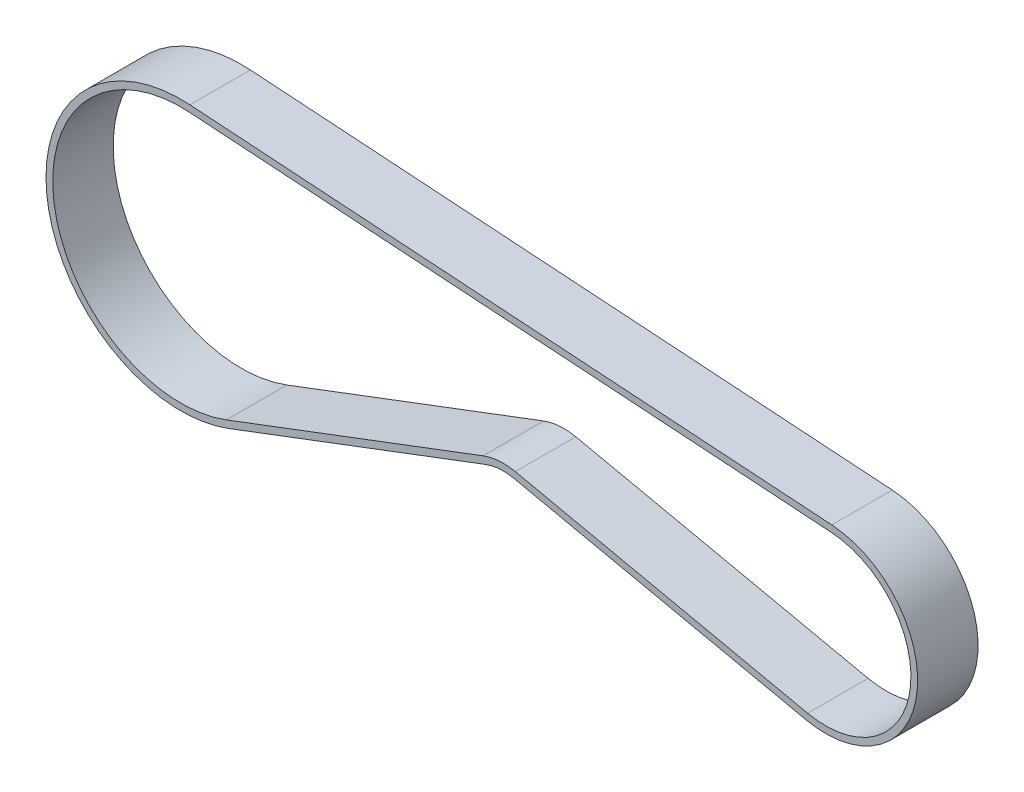
ISO-10303-21;
HEADER;
FILE_DESCRIPTION(('STEP AP214'),'2;1');
FILE_NAME('part.step','',(''),(''),'','','');
FILE_SCHEMA(('AUTOMOTIVE_DESIGN { 1 0 10303 214 1 1 1 1 }'));
ENDSEC;
DATA;
#1=APPLICATION_CONTEXT('core data for automotive mechanical design processes');
#2=APPLICATION_PROTOCOL_DEFINITION('international standard','automotive_design',2000,#1);
#3=PRODUCT_CONTEXT('',#1,'mechanical');
#4=PRODUCT('Part','Part','',(#3));
#5=PRODUCT_RELATED_PRODUCT_CATEGORY('part','',(#4));
#6=PRODUCT_DEFINITION_FORMATION('','',#4);
#7=PRODUCT_DEFINITION_CONTEXT('part definition',#1,'design');
#8=PRODUCT_DEFINITION('design','',#6,#7);
#9=PRODUCT_DEFINITION_SHAPE('','',#8);
#10=(LENGTH_UNIT() NAMED_UNIT(*) SI_UNIT(.MILLI.,.METRE.));
#11=(NAMED_UNIT(*) PLANE_ANGLE_UNIT() SI_UNIT($,.RADIAN.));
#12=(NAMED_UNIT(*) SI_UNIT($,.STERADIAN.) SOLID_ANGLE_UNIT());
#13=UNCERTAINTY_MEASURE_WITH_UNIT(LENGTH_MEASURE(1.E-05),#10,'distance_accuracy_value','');
#14=(GEOMETRIC_REPRESENTATION_CONTEXT(3) GLOBAL_UNCERTAINTY_ASSIGNED_CONTEXT((#13)) GLOBAL_UNIT_ASSIGNED_CONTEXT((#10,
#11,#12)) REPRESENTATION_CONTEXT('',''));
#15=CARTESIAN_POINT('',(0.,0.,0.));
#16=DIRECTION('',(0.,0.,1.));
#17=DIRECTION('',(1.,0.,0.));
#18=AXIS2_PLACEMENT_3D('',#15,#16,#17);
#19=CARTESIAN_POINT('',(0.,0.,4.5));
#20=DIRECTION('',(0.,0.,-1.));
#21=DIRECTION('',(-1.,0.,0.));
#22=AXIS2_PLACEMENT_3D('',#19,#20,#21);
#23=PLANE('',#22);
#24=CARTESIAN_POINT('',(0.,0.,4.5));
#25=DIRECTION('',(0.,0.,1.));
#26=DIRECTION('',(-1.,0.,0.));
#27=AXIS2_PLACEMENT_3D('',#24,#25,#26);
#28=CIRCLE('',#27,13.7);
#29=CARTESIAN_POINT('',(-2.88860996232557,-13.3920100240985,4.5));
#30=VERTEX_POINT('',#29);
#31=CARTESIAN_POINT('',(0.913333333333334,13.6695216530141,4.5));
#32=VERTEX_POINT('',#31);
#33=EDGE_CURVE('E198',#30,#32,#28,.T.);
#34=ORIENTED_EDGE('',*,*,#33,.T.);
#35=DIRECTION('',(-0.997775303139718,0.0666666666666667,0.));
#36=VECTOR('',#35,1.);
#37=CARTESIAN_POINT('',(0.913333333333334,13.6695216530141,4.5));
#38=LINE('',#37,#36);
#39=CARTESIAN_POINT('',(-94.66,20.0552835931083,4.5));
#40=VERTEX_POINT('',#39);
#41=EDGE_CURVE('E202',#32,#40,#38,.T.);
#42=ORIENTED_EDGE('',*,*,#41,.T.);
#43=CARTESIAN_POINT('',(-96.,0.,4.5));
#44=DIRECTION('',(0.,0.,1.));
#45=DIRECTION('',(1.,0.,0.));
#46=AXIS2_PLACEMENT_3D('',#43,#44,#45);
#47=CIRCLE('',#46,20.1);
#48=CARTESIAN_POINT('',(-88.8810079901692,-18.7970729839506,4.5));
#49=VERTEX_POINT('',#48);
#50=EDGE_CURVE('E206',#40,#49,#47,.T.);
#51=ORIENTED_EDGE('',*,*,#50,.T.);
#52=DIRECTION('',(0.935177760395552,0.354178706956756,0.));
#53=VECTOR('',#52,1.);
#54=CARTESIAN_POINT('',(-50.6563403021757,-4.320292259547,4.5));
#55=LINE('',#54,#53);
#56=CARTESIAN_POINT('',(-50.6563403021757,-4.320292259547,4.5));
#57=VERTEX_POINT('',#56);
#58=EDGE_CURVE('E209',#49,#57,#55,.T.);
#59=ORIENTED_EDGE('',*,*,#58,.T.);
#60=CARTESIAN_POINT('',(-48.,-11.3341254625136,4.5));
#61=DIRECTION('',(0.,0.,-1.));
#62=DIRECTION('',(1.,0.,0.));
#63=AXIS2_PLACEMENT_3D('',#60,#61,#62);
#64=CIRCLE('',#63,7.5);
#65=CARTESIAN_POINT('',(-46.4186441812086,-4.00273311355464,4.5));
#66=VERTEX_POINT('',#65);
#67=EDGE_CURVE('E212',#57,#66,#64,.T.);
#68=ORIENTED_EDGE('',*,*,#67,.T.);
#69=DIRECTION('',(0.977518979861201,-0.210847442505517,0.));
#70=VECTOR('',#69,1.);
#71=CARTESIAN_POINT('',(-46.4186441812086,-4.00273311355464,4.5));
#72=LINE('',#71,#70);
#73=EDGE_CURVE('E215',#66,#30,#72,.T.);
#74=ORIENTED_EDGE('',*,*,#73,.T.);
#75=EDGE_LOOP('',(#34,#42,#51,#59,#68,#74));
#76=FACE_BOUND('',#75,.T.);
#77=CARTESIAN_POINT('',(0.,0.,4.5));
#78=DIRECTION('',(0.,0.,1.));
#79=DIRECTION('',(-1.,0.,0.));
#80=AXIS2_PLACEMENT_3D('',#77,#78,#79);
#81=CIRCLE('',#80,12.7);
#82=CARTESIAN_POINT('',(-2.67776251982006,-12.4144910442373,4.5));
#83=VERTEX_POINT('',#82);
#84=CARTESIAN_POINT('',(0.846666666666667,12.6717463498744,4.5));
#85=VERTEX_POINT('',#84);
#86=EDGE_CURVE('E129',#83,#85,#81,.T.);
#87=ORIENTED_EDGE('',*,*,#86,.F.);
#88=DIRECTION('',(0.977518979861201,-0.210847442505517,0.));
#89=VECTOR('',#88,1.);
#90=CARTESIAN_POINT('',(-46.2077967387031,-3.02521413369344,4.5));
#91=LINE('',#90,#89);
#92=CARTESIAN_POINT('',(-46.2077967387031,-3.02521413369344,4.5));
#93=VERTEX_POINT('',#92);
#94=EDGE_CURVE('E164',#93,#83,#91,.T.);
#95=ORIENTED_EDGE('',*,*,#94,.F.);
#96=CARTESIAN_POINT('',(-48.,-11.3341254625136,4.5));
#97=DIRECTION('',(0.,0.,-1.));
#98=DIRECTION('',(1.,0.,0.));
#99=AXIS2_PLACEMENT_3D('',#96,#97,#98);
#100=CIRCLE('',#99,8.5);
#101=CARTESIAN_POINT('',(-51.0105190091324,-3.38511449915145,4.5));
#102=VERTEX_POINT('',#101);
#103=EDGE_CURVE('E161',#102,#93,#100,.T.);
#104=ORIENTED_EDGE('',*,*,#103,.F.);
#105=DIRECTION('',(0.935177760395552,0.354178706956756,0.));
#106=VECTOR('',#105,1.);
#107=CARTESIAN_POINT('',(-51.0105190091324,-3.38511449915145,4.5));
#108=LINE('',#107,#106);
#109=CARTESIAN_POINT('',(-89.235186697126,-17.861895223555,4.5));
#110=VERTEX_POINT('',#109);
#111=EDGE_CURVE('E156',#110,#102,#108,.T.);
#112=ORIENTED_EDGE('',*,*,#111,.F.);
#113=CARTESIAN_POINT('',(-96.,0.,4.5));
#114=DIRECTION('',(0.,0.,1.));
#115=DIRECTION('',(1.,0.,0.));
#116=AXIS2_PLACEMENT_3D('',#113,#114,#115);
#117=CIRCLE('',#116,19.1);
#118=CARTESIAN_POINT('',(-94.7266666666667,19.0575082899686,4.5));
#119=VERTEX_POINT('',#118);
#120=EDGE_CURVE('E152',#119,#110,#117,.T.);
#121=ORIENTED_EDGE('',*,*,#120,.F.);
#122=DIRECTION('',(-0.997775303139718,0.0666666666666667,0.));
#123=VECTOR('',#122,1.);
#124=CARTESIAN_POINT('',(0.846666666666667,12.6717463498744,4.5));
#125=LINE('',#124,#123);
#126=EDGE_CURVE('E138',#85,#119,#125,.T.);
#127=ORIENTED_EDGE('',*,*,#126,.F.);
#128=EDGE_LOOP('',(#87,#95,#104,#112,#121,#127));
#129=FACE_BOUND('',#128,.T.);
#130=ADVANCED_FACE('F39',(#76,#129),#23,.F.);
#131=CARTESIAN_POINT('',(0.,0.,-4.5));
#132=DIRECTION('',(0.,0.,-1.));
#133=DIRECTION('',(-1.,0.,0.));
#134=AXIS2_PLACEMENT_3D('',#131,#132,#133);
#135=PLANE('',#134);
#136=CARTESIAN_POINT('',(0.,0.,-4.5));
#137=DIRECTION('',(0.,0.,1.));
#138=DIRECTION('',(-1.,0.,0.));
#139=AXIS2_PLACEMENT_3D('',#136,#137,#138);
#140=CIRCLE('',#139,13.7);
#141=CARTESIAN_POINT('',(-2.88860996232557,-13.3920100240985,-4.5));
#142=VERTEX_POINT('',#141);
#143=CARTESIAN_POINT('',(0.913333333333334,13.6695216530141,-4.5));
#144=VERTEX_POINT('',#143);
#145=EDGE_CURVE('E147',#142,#144,#140,.T.);
#146=ORIENTED_EDGE('',*,*,#145,.F.);
#147=DIRECTION('',(0.977518979861201,-0.210847442505517,0.));
#148=VECTOR('',#147,1.);
#149=CARTESIAN_POINT('',(-46.4186441812086,-4.00273311355464,-4.5));
#150=LINE('',#149,#148);
#151=CARTESIAN_POINT('',(-46.4186441812086,-4.00273311355464,-4.5));
#152=VERTEX_POINT('',#151);
#153=EDGE_CURVE('E203',#152,#142,#150,.T.);
#154=ORIENTED_EDGE('',*,*,#153,.F.);
#155=CARTESIAN_POINT('',(-48.,-11.3341254625136,-4.5));
#156=DIRECTION('',(0.,0.,-1.));
#157=DIRECTION('',(1.,0.,0.));
#158=AXIS2_PLACEMENT_3D('',#155,#156,#157);
#159=CIRCLE('',#158,7.5);
#160=CARTESIAN_POINT('',(-50.6563403021757,-4.320292259547,-4.5));
#161=VERTEX_POINT('',#160);
#162=EDGE_CURVE('E231',#161,#152,#159,.T.);
#163=ORIENTED_EDGE('',*,*,#162,.F.);
#164=DIRECTION('',(0.935177760395552,0.354178706956756,0.));
#165=VECTOR('',#164,1.);
#166=CARTESIAN_POINT('',(-50.6563403021757,-4.320292259547,-4.5));
#167=LINE('',#166,#165);
#168=CARTESIAN_POINT('',(-88.8810079901692,-18.7970729839506,-4.5));
#169=VERTEX_POINT('',#168);
#170=EDGE_CURVE('E228',#169,#161,#167,.T.);
#171=ORIENTED_EDGE('',*,*,#170,.F.);
#172=CARTESIAN_POINT('',(-96.,0.,-4.5));
#173=DIRECTION('',(0.,0.,1.));
#174=DIRECTION('',(1.,0.,0.));
#175=AXIS2_PLACEMENT_3D('',#172,#173,#174);
#176=CIRCLE('',#175,20.1);
#177=CARTESIAN_POINT('',(-94.66,20.0552835931083,-4.5));
#178=VERTEX_POINT('',#177);
#179=EDGE_CURVE('E225',#178,#169,#176,.T.);
#180=ORIENTED_EDGE('',*,*,#179,.F.);
#181=DIRECTION('',(-0.997775303139718,0.0666666666666667,0.));
#182=VECTOR('',#181,1.);
#183=CARTESIAN_POINT('',(0.913333333333334,13.6695216530141,-4.5));
#184=LINE('',#183,#182);
#185=EDGE_CURVE('E222',#144,#178,#184,.T.);
#186=ORIENTED_EDGE('',*,*,#185,.F.);
#187=EDGE_LOOP('',(#146,#154,#163,#171,#180,#186));
#188=FACE_BOUND('',#187,.T.);
#189=DIRECTION('',(0.977518979861201,-0.210847442505517,0.));
#190=VECTOR('',#189,1.);
#191=CARTESIAN_POINT('',(-46.2077967387031,-3.02521413369344,-4.5));
#192=LINE('',#191,#190);
#193=CARTESIAN_POINT('',(-46.2077967387031,-3.02521413369344,-4.5));
#194=VERTEX_POINT('',#193);
#195=CARTESIAN_POINT('',(-2.67776251982006,-12.4144910442373,-4.5));
#196=VERTEX_POINT('',#195);
#197=EDGE_CURVE('E139',#194,#196,#192,.T.);
#198=ORIENTED_EDGE('',*,*,#197,.T.);
#199=CARTESIAN_POINT('',(0.,0.,-4.5));
#200=DIRECTION('',(0.,0.,1.));
#201=DIRECTION('',(-1.,0.,0.));
#202=AXIS2_PLACEMENT_3D('',#199,#200,#201);
#203=CIRCLE('',#202,12.7);
#204=CARTESIAN_POINT('',(0.846666666666667,12.6717463498744,-4.5));
#205=VERTEX_POINT('',#204);
#206=EDGE_CURVE('E63',#196,#205,#203,.T.);
#207=ORIENTED_EDGE('',*,*,#206,.T.);
#208=DIRECTION('',(-0.997775303139718,0.0666666666666667,0.));
#209=VECTOR('',#208,1.);
#210=CARTESIAN_POINT('',(0.846666666666667,12.6717463498744,-4.5));
#211=LINE('',#210,#209);
#212=CARTESIAN_POINT('',(-94.7266666666667,19.0575082899686,-4.5));
#213=VERTEX_POINT('',#212);
#214=EDGE_CURVE('E145',#205,#213,#211,.T.);
#215=ORIENTED_EDGE('',*,*,#214,.T.);
#216=CARTESIAN_POINT('',(-96.,0.,-4.5));
#217=DIRECTION('',(0.,0.,1.));
#218=DIRECTION('',(1.,0.,0.));
#219=AXIS2_PLACEMENT_3D('',#216,#217,#218);
#220=CIRCLE('',#219,19.1);
#221=CARTESIAN_POINT('',(-89.235186697126,-17.861895223555,-4.5));
#222=VERTEX_POINT('',#221);
#223=EDGE_CURVE('E171',#213,#222,#220,.T.);
#224=ORIENTED_EDGE('',*,*,#223,.T.);
#225=DIRECTION('',(0.935177760395552,0.354178706956756,0.));
#226=VECTOR('',#225,1.);
#227=CARTESIAN_POINT('',(-51.0105190091324,-3.38511449915145,-4.5));
#228=LINE('',#227,#226);
#229=CARTESIAN_POINT('',(-51.0105190091324,-3.38511449915145,-4.5));
#230=VERTEX_POINT('',#229);
#231=EDGE_CURVE('E175',#222,#230,#228,.T.);
#232=ORIENTED_EDGE('',*,*,#231,.T.);
#233=CARTESIAN_POINT('',(-48.,-11.3341254625136,-4.5));
#234=DIRECTION('',(0.,0.,-1.));
#235=DIRECTION('',(1.,0.,0.));
#236=AXIS2_PLACEMENT_3D('',#233,#234,#235);
#237=CIRCLE('',#236,8.5);
#238=EDGE_CURVE('E179',#230,#194,#237,.T.);
#239=ORIENTED_EDGE('',*,*,#238,.T.);
#240=EDGE_LOOP('',(#198,#207,#215,#224,#232,#239));
#241=FACE_BOUND('',#240,.T.);
#242=ADVANCED_FACE('F262',(#188,#241),#135,.T.);
#243=CARTESIAN_POINT('',(0.,0.,4.5));
#244=DIRECTION('',(0.,0.,-1.));
#245=DIRECTION('',(-1.,0.,0.));
#246=AXIS2_PLACEMENT_3D('',#243,#244,#245);
#247=CYLINDRICAL_SURFACE('',#246,13.7);
#248=ORIENTED_EDGE('',*,*,#145,.T.);
#249=DIRECTION('',(0.,0.,-1.));
#250=VECTOR('',#249,1.);
#251=CARTESIAN_POINT('',(0.913333333333334,13.6695216530141,4.5));
#252=LINE('',#251,#250);
#253=EDGE_CURVE('E11',#32,#144,#252,.T.);
#254=ORIENTED_EDGE('',*,*,#253,.F.);
#255=ORIENTED_EDGE('',*,*,#33,.F.);
#256=DIRECTION('',(0.,0.,-1.));
#257=VECTOR('',#256,1.);
#258=CARTESIAN_POINT('',(-2.88860996232557,-13.3920100240985,4.5));
#259=LINE('',#258,#257);
#260=EDGE_CURVE('E218',#30,#142,#259,.T.);
#261=ORIENTED_EDGE('',*,*,#260,.T.);
#262=EDGE_LOOP('',(#248,#254,#255,#261));
#263=FACE_BOUND('',#262,.T.);
#264=ADVANCED_FACE('F41',(#263),#247,.T.);
#265=CARTESIAN_POINT('',(0.913333333333334,13.6695216530141,4.5));
#266=DIRECTION('',(-0.0666666666666667,-0.997775303139718,0.));
#267=DIRECTION('',(0.997775303139718,-0.0666666666666667,0.));
#268=AXIS2_PLACEMENT_3D('',#265,#266,#267);
#269=PLANE('',#268);
#270=ORIENTED_EDGE('',*,*,#185,.T.);
#271=DIRECTION('',(0.,0.,-1.));
#272=VECTOR('',#271,1.);
#273=CARTESIAN_POINT('',(-94.66,20.0552835931083,4.5));
#274=LINE('',#273,#272);
#275=EDGE_CURVE('E48',#40,#178,#274,.T.);
#276=ORIENTED_EDGE('',*,*,#275,.F.);
#277=ORIENTED_EDGE('',*,*,#41,.F.);
#278=ORIENTED_EDGE('',*,*,#253,.T.);
#279=EDGE_LOOP('',(#270,#276,#277,#278));
#280=FACE_BOUND('',#279,.T.);
#281=ADVANCED_FACE('F279',(#280),#269,.F.);
#282=CARTESIAN_POINT('',(-96.,0.,4.5));
#283=DIRECTION('',(0.,0.,-1.));
#284=DIRECTION('',(-1.,0.,0.));
#285=AXIS2_PLACEMENT_3D('',#282,#283,#284);
#286=CYLINDRICAL_SURFACE('',#285,20.1);
#287=ORIENTED_EDGE('',*,*,#179,.T.);
#288=DIRECTION('',(0.,0.,-1.));
#289=VECTOR('',#288,1.);
#290=CARTESIAN_POINT('',(-88.8810079901692,-18.7970729839506,4.5));
#291=LINE('',#290,#289);
#292=EDGE_CURVE('E247',#49,#169,#291,.T.);
#293=ORIENTED_EDGE('',*,*,#292,.F.);
#294=ORIENTED_EDGE('',*,*,#50,.F.);
#295=ORIENTED_EDGE('',*,*,#275,.T.);
#296=EDGE_LOOP('',(#287,#293,#294,#295));
#297=FACE_BOUND('',#296,.T.);
#298=ADVANCED_FACE('F256',(#297),#286,.T.);
#299=CARTESIAN_POINT('',(-50.6563403021757,-4.320292259547,4.5));
#300=DIRECTION('',(-0.354178706956756,0.935177760395552,0.));
#301=DIRECTION('',(-0.935177760395552,-0.354178706956756,0.));
#302=AXIS2_PLACEMENT_3D('',#299,#300,#301);
#303=PLANE('',#302);
#304=ORIENTED_EDGE('',*,*,#170,.T.);
#305=DIRECTION('',(0.,0.,-1.));
#306=VECTOR('',#305,1.);
#307=CARTESIAN_POINT('',(-50.6563403021757,-4.320292259547,4.5));
#308=LINE('',#307,#306);
#309=EDGE_CURVE('E243',#57,#161,#308,.T.);
#310=ORIENTED_EDGE('',*,*,#309,.F.);
#311=ORIENTED_EDGE('',*,*,#58,.F.);
#312=ORIENTED_EDGE('',*,*,#292,.T.);
#313=EDGE_LOOP('',(#304,#310,#311,#312));
#314=FACE_BOUND('',#313,.T.);
#315=ADVANCED_FACE('F268',(#314),#303,.F.);
#316=CARTESIAN_POINT('',(-48.,-11.3341254625136,4.5));
#317=DIRECTION('',(0.,0.,-1.));
#318=DIRECTION('',(-1.,0.,0.));
#319=AXIS2_PLACEMENT_3D('',#316,#317,#318);
#320=CYLINDRICAL_SURFACE('',#319,7.5);
#321=ORIENTED_EDGE('',*,*,#162,.T.);
#322=DIRECTION('',(0.,0.,-1.));
#323=VECTOR('',#322,1.);
#324=CARTESIAN_POINT('',(-46.4186441812086,-4.00273311355464,4.5));
#325=LINE('',#324,#323);
#326=EDGE_CURVE('E239',#66,#152,#325,.T.);
#327=ORIENTED_EDGE('',*,*,#326,.F.);
#328=ORIENTED_EDGE('',*,*,#67,.F.);
#329=ORIENTED_EDGE('',*,*,#309,.T.);
#330=EDGE_LOOP('',(#321,#327,#328,#329));
#331=FACE_BOUND('',#330,.T.);
#332=ADVANCED_FACE('F272',(#331),#320,.F.);
#333=CARTESIAN_POINT('',(-46.4186441812086,-4.00273311355464,4.5));
#334=DIRECTION('',(0.210847442505517,0.977518979861201,0.));
#335=DIRECTION('',(-0.977518979861201,0.210847442505517,0.));
#336=AXIS2_PLACEMENT_3D('',#333,#334,#335);
#337=PLANE('',#336);
#338=ORIENTED_EDGE('',*,*,#153,.T.);
#339=ORIENTED_EDGE('',*,*,#260,.F.);
#340=ORIENTED_EDGE('',*,*,#73,.F.);
#341=ORIENTED_EDGE('',*,*,#326,.T.);
#342=EDGE_LOOP('',(#338,#339,#340,#341));
#343=FACE_BOUND('',#342,.T.);
#344=ADVANCED_FACE('F282',(#343),#337,.F.);
#345=CARTESIAN_POINT('',(0.,0.,4.5));
#346=DIRECTION('',(0.,0.,-1.));
#347=DIRECTION('',(-1.,0.,0.));
#348=AXIS2_PLACEMENT_3D('',#345,#346,#347);
#349=CYLINDRICAL_SURFACE('',#348,12.7);
#350=ORIENTED_EDGE('',*,*,#206,.F.);
#351=DIRECTION('',(0.,0.,-1.));
#352=VECTOR('',#351,1.);
#353=CARTESIAN_POINT('',(-2.67776251982006,-12.4144910442373,4.5));
#354=LINE('',#353,#352);
#355=EDGE_CURVE('E133',#83,#196,#354,.T.);
#356=ORIENTED_EDGE('',*,*,#355,.F.);
#357=ORIENTED_EDGE('',*,*,#86,.T.);
#358=DIRECTION('',(0.,0.,-1.));
#359=VECTOR('',#358,1.);
#360=CARTESIAN_POINT('',(0.846666666666667,12.6717463498744,4.5));
#361=LINE('',#360,#359);
#362=EDGE_CURVE('E132',#85,#205,#361,.T.);
#363=ORIENTED_EDGE('',*,*,#362,.T.);
#364=EDGE_LOOP('',(#350,#356,#357,#363));
#365=FACE_BOUND('',#364,.T.);
#366=ADVANCED_FACE('F131',(#365),#349,.F.);
#367=CARTESIAN_POINT('',(0.846666666666667,12.6717463498744,4.5));
#368=DIRECTION('',(-0.0666666666666667,-0.997775303139718,0.));
#369=DIRECTION('',(0.997775303139718,-0.0666666666666667,0.));
#370=AXIS2_PLACEMENT_3D('',#367,#368,#369);
#371=PLANE('',#370);
#372=ORIENTED_EDGE('',*,*,#214,.F.);
#373=ORIENTED_EDGE('',*,*,#362,.F.);
#374=ORIENTED_EDGE('',*,*,#126,.T.);
#375=DIRECTION('',(0.,0.,-1.));
#376=VECTOR('',#375,1.);
#377=CARTESIAN_POINT('',(-94.7266666666667,19.0575082899686,4.5));
#378=LINE('',#377,#376);
#379=EDGE_CURVE('E148',#119,#213,#378,.T.);
#380=ORIENTED_EDGE('',*,*,#379,.T.);
#381=EDGE_LOOP('',(#372,#373,#374,#380));
#382=FACE_BOUND('',#381,.T.);
#383=ADVANCED_FACE('F142',(#382),#371,.T.);
#384=CARTESIAN_POINT('',(-96.,0.,4.5));
#385=DIRECTION('',(0.,0.,-1.));
#386=DIRECTION('',(-1.,0.,0.));
#387=AXIS2_PLACEMENT_3D('',#384,#385,#386);
#388=CYLINDRICAL_SURFACE('',#387,19.1);
#389=ORIENTED_EDGE('',*,*,#223,.F.);
#390=ORIENTED_EDGE('',*,*,#379,.F.);
#391=ORIENTED_EDGE('',*,*,#120,.T.);
#392=DIRECTION('',(0.,0.,-1.));
#393=VECTOR('',#392,1.);
#394=CARTESIAN_POINT('',(-89.235186697126,-17.861895223555,4.5));
#395=LINE('',#394,#393);
#396=EDGE_CURVE('E193',#110,#222,#395,.T.);
#397=ORIENTED_EDGE('',*,*,#396,.T.);
#398=EDGE_LOOP('',(#389,#390,#391,#397));
#399=FACE_BOUND('',#398,.T.);
#400=ADVANCED_FACE('F300',(#399),#388,.F.);
#401=CARTESIAN_POINT('',(-51.0105190091324,-3.38511449915145,4.5));
#402=DIRECTION('',(-0.354178706956756,0.935177760395552,0.));
#403=DIRECTION('',(-0.935177760395552,-0.354178706956756,0.));
#404=AXIS2_PLACEMENT_3D('',#401,#402,#403);
#405=PLANE('',#404);
#406=ORIENTED_EDGE('',*,*,#231,.F.);
#407=ORIENTED_EDGE('',*,*,#396,.F.);
#408=ORIENTED_EDGE('',*,*,#111,.T.);
#409=DIRECTION('',(0.,0.,-1.));
#410=VECTOR('',#409,1.);
#411=CARTESIAN_POINT('',(-51.0105190091324,-3.38511449915145,4.5));
#412=LINE('',#411,#410);
#413=EDGE_CURVE('E190',#102,#230,#412,.T.);
#414=ORIENTED_EDGE('',*,*,#413,.T.);
#415=EDGE_LOOP('',(#406,#407,#408,#414));
#416=FACE_BOUND('',#415,.T.);
#417=ADVANCED_FACE('F303',(#416),#405,.T.);
#418=CARTESIAN_POINT('',(-48.,-11.3341254625136,4.5));
#419=DIRECTION('',(0.,0.,-1.));
#420=DIRECTION('',(-1.,0.,0.));
#421=AXIS2_PLACEMENT_3D('',#418,#419,#420);
#422=CYLINDRICAL_SURFACE('',#421,8.5);
#423=ORIENTED_EDGE('',*,*,#238,.F.);
#424=ORIENTED_EDGE('',*,*,#413,.F.);
#425=ORIENTED_EDGE('',*,*,#103,.T.);
#426=DIRECTION('',(0.,0.,-1.));
#427=VECTOR('',#426,1.);
#428=CARTESIAN_POINT('',(-46.2077967387031,-3.02521413369344,4.5));
#429=LINE('',#428,#427);
#430=EDGE_CURVE('E55',#93,#194,#429,.T.);
#431=ORIENTED_EDGE('',*,*,#430,.T.);
#432=EDGE_LOOP('',(#423,#424,#425,#431));
#433=FACE_BOUND('',#432,.T.);
#434=ADVANCED_FACE('F307',(#433),#422,.T.);
#435=CARTESIAN_POINT('',(-46.2077967387031,-3.02521413369344,4.5));
#436=DIRECTION('',(0.210847442505517,0.977518979861201,0.));
#437=DIRECTION('',(-0.977518979861201,0.210847442505517,0.));
#438=AXIS2_PLACEMENT_3D('',#435,#436,#437);
#439=PLANE('',#438);
#440=ORIENTED_EDGE('',*,*,#197,.F.);
#441=ORIENTED_EDGE('',*,*,#430,.F.);
#442=ORIENTED_EDGE('',*,*,#94,.T.);
#443=ORIENTED_EDGE('',*,*,#355,.T.);
#444=EDGE_LOOP('',(#440,#441,#442,#443));
#445=FACE_BOUND('',#444,.T.);
#446=ADVANCED_FACE('F311',(#445),#439,.T.);
#447=CLOSED_SHELL('',(#130,#242,#264,#281,#298,#315,#332,#344,#366,#383,#400,#417,#434,#446));
#448=MANIFOLD_SOLID_BREP('B2',#447);
#449=ADVANCED_BREP_SHAPE_REPRESENTATION('',(#18,#448),#14);
#450=SHAPE_DEFINITION_REPRESENTATION(#9,#449);
ENDSEC;
END-ISO-10303-21;
